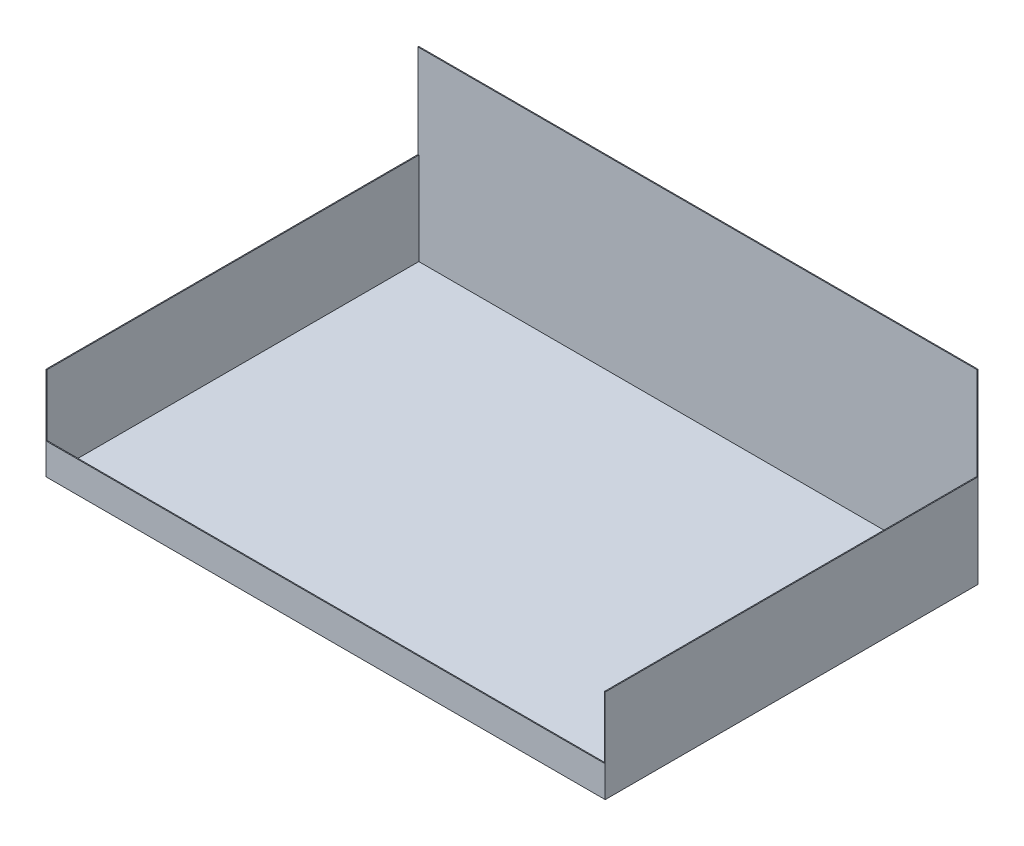
ISO-10303-21;
HEADER;
FILE_DESCRIPTION(('STEP AP214'),'2;1');
FILE_NAME('part.step','',(''),(''),'','','');
FILE_SCHEMA(('AUTOMOTIVE_DESIGN { 1 0 10303 214 1 1 1 1 }'));
ENDSEC;
DATA;
#1=APPLICATION_CONTEXT('core data for automotive mechanical design processes');
#2=APPLICATION_PROTOCOL_DEFINITION('international standard','automotive_design',2000,#1);
#3=PRODUCT_CONTEXT('',#1,'mechanical');
#4=PRODUCT('Part','Part','',(#3));
#5=PRODUCT_RELATED_PRODUCT_CATEGORY('part','',(#4));
#6=PRODUCT_DEFINITION_FORMATION('','',#4);
#7=PRODUCT_DEFINITION_CONTEXT('part definition',#1,'design');
#8=PRODUCT_DEFINITION('design','',#6,#7);
#9=PRODUCT_DEFINITION_SHAPE('','',#8);
#10=(LENGTH_UNIT() NAMED_UNIT(*) SI_UNIT(.MILLI.,.METRE.));
#11=(NAMED_UNIT(*) PLANE_ANGLE_UNIT() SI_UNIT($,.RADIAN.));
#12=(NAMED_UNIT(*) SI_UNIT($,.STERADIAN.) SOLID_ANGLE_UNIT());
#13=UNCERTAINTY_MEASURE_WITH_UNIT(LENGTH_MEASURE(1.E-05),#10,'distance_accuracy_value','');
#14=(GEOMETRIC_REPRESENTATION_CONTEXT(3) GLOBAL_UNCERTAINTY_ASSIGNED_CONTEXT((#13)) GLOBAL_UNIT_ASSIGNED_CONTEXT((#10,
#11,#12)) REPRESENTATION_CONTEXT('',''));
#15=CARTESIAN_POINT('',(0.,0.,0.));
#16=DIRECTION('',(0.,0.,1.));
#17=DIRECTION('',(1.,0.,0.));
#18=AXIS2_PLACEMENT_3D('',#15,#16,#17);
#19=CARTESIAN_POINT('',(0.,0.,0.));
#20=DIRECTION('',(0.,0.,1.));
#21=DIRECTION('',(1.,0.,0.));
#22=AXIS2_PLACEMENT_3D('',#19,#20,#21);
#23=PLANE('',#22);
#24=DIRECTION('',(1.,0.,0.));
#25=VECTOR('',#24,1.);
#26=CARTESIAN_POINT('',(-1777.58960514661,52.6595744680851,0.));
#27=LINE('',#26,#25);
#28=CARTESIAN_POINT('',(524.031914893617,52.6595744680851,0.));
#29=VERTEX_POINT('',#28);
#30=CARTESIAN_POINT('',(525.531914893617,52.6595744680851,0.));
#31=VERTEX_POINT('',#30);
#32=EDGE_CURVE('E187',#29,#31,#27,.T.);
#33=ORIENTED_EDGE('',*,*,#32,.F.);
#34=DIRECTION('',(0.,1.,0.));
#35=VECTOR('',#34,1.);
#36=CARTESIAN_POINT('',(524.031914893617,-47.3404255319149,0.));
#37=LINE('',#36,#35);
#38=CARTESIAN_POINT('',(524.031914893617,-47.3404255319149,0.));
#39=VERTEX_POINT('',#38);
#40=EDGE_CURVE('E159',#39,#29,#37,.T.);
#41=ORIENTED_EDGE('',*,*,#40,.F.);
#42=DIRECTION('',(1.,0.,0.));
#43=VECTOR('',#42,1.);
#44=CARTESIAN_POINT('',(-372.968085106383,-47.3404255319149,0.));
#45=LINE('',#44,#43);
#46=CARTESIAN_POINT('',(-372.968085106383,-47.3404255319149,0.));
#47=VERTEX_POINT('',#46);
#48=EDGE_CURVE('E161',#47,#39,#45,.T.);
#49=ORIENTED_EDGE('',*,*,#48,.F.);
#50=DIRECTION('',(0.,-1.,0.));
#51=VECTOR('',#50,1.);
#52=CARTESIAN_POINT('',(-372.968085106383,52.6595744680851,0.));
#53=LINE('',#52,#51);
#54=CARTESIAN_POINT('',(-372.968085106383,52.6595744680851,0.));
#55=VERTEX_POINT('',#54);
#56=EDGE_CURVE('E163',#55,#47,#53,.T.);
#57=ORIENTED_EDGE('',*,*,#56,.F.);
#58=CARTESIAN_POINT('',(-374.468085106383,52.6595744680851,0.));
#59=VERTEX_POINT('',#58);
#60=EDGE_CURVE('E188',#59,#55,#27,.T.);
#61=ORIENTED_EDGE('',*,*,#60,.F.);
#62=DIRECTION('',(0.,-1.,0.));
#63=VECTOR('',#62,1.);
#64=CARTESIAN_POINT('',(-374.468085106383,202.659574468085,0.));
#65=LINE('',#64,#63);
#66=CARTESIAN_POINT('',(-374.468085106383,-97.3404255319149,0.));
#67=VERTEX_POINT('',#66);
#68=EDGE_CURVE('E178',#59,#67,#65,.T.);
#69=ORIENTED_EDGE('',*,*,#68,.T.);
#70=DIRECTION('',(1.,0.,0.));
#71=VECTOR('',#70,1.);
#72=CARTESIAN_POINT('',(-374.468085106383,-97.3404255319149,0.));
#73=LINE('',#72,#71);
#74=CARTESIAN_POINT('',(525.531914893617,-97.3404255319149,0.));
#75=VERTEX_POINT('',#74);
#76=EDGE_CURVE('E208',#67,#75,#73,.T.);
#77=ORIENTED_EDGE('',*,*,#76,.T.);
#78=DIRECTION('',(0.,1.,0.));
#79=VECTOR('',#78,1.);
#80=CARTESIAN_POINT('',(525.531914893617,202.659574468085,0.));
#81=LINE('',#80,#79);
#82=EDGE_CURVE('E198',#75,#31,#81,.T.);
#83=ORIENTED_EDGE('',*,*,#82,.T.);
#84=EDGE_LOOP('',(#33,#41,#49,#57,#61,#69,#77,#83));
#85=FACE_BOUND('',#84,.T.);
#86=ADVANCED_FACE('F33',(#85),#23,.T.);
#87=CARTESIAN_POINT('',(-1777.58960514661,52.6595744680851,-598.5));
#88=DIRECTION('',(0.,1.,0.));
#89=DIRECTION('',(0.,0.,1.));
#90=AXIS2_PLACEMENT_3D('',#87,#88,#89);
#91=PLANE('',#90);
#92=DIRECTION('',(1.,0.,0.));
#93=VECTOR('',#92,1.);
#94=CARTESIAN_POINT('',(-1777.58960514661,52.6595744680851,-598.5));
#95=LINE('',#94,#93);
#96=CARTESIAN_POINT('',(524.031914893617,52.6595744680851,-598.5));
#97=VERTEX_POINT('',#96);
#98=CARTESIAN_POINT('',(525.531914893617,52.6595744680851,-598.5));
#99=VERTEX_POINT('',#98);
#100=EDGE_CURVE('E190',#97,#99,#95,.T.);
#101=ORIENTED_EDGE('',*,*,#100,.F.);
#102=DIRECTION('',(0.,0.,-1.));
#103=VECTOR('',#102,1.);
#104=CARTESIAN_POINT('',(524.031914893617,52.6595744680851,1403.12152004023));
#105=LINE('',#104,#103);
#106=EDGE_CURVE('E50',#29,#97,#105,.T.);
#107=ORIENTED_EDGE('',*,*,#106,.F.);
#108=ORIENTED_EDGE('',*,*,#32,.T.);
#109=DIRECTION('',(0.,0.,1.));
#110=VECTOR('',#109,1.);
#111=CARTESIAN_POINT('',(525.531914893617,52.6595744680851,-598.5));
#112=LINE('',#111,#110);
#113=EDGE_CURVE('E181',#99,#31,#112,.T.);
#114=ORIENTED_EDGE('',*,*,#113,.F.);
#115=EDGE_LOOP('',(#101,#107,#108,#114));
#116=FACE_BOUND('',#115,.T.);
#117=ADVANCED_FACE('F241',(#116),#91,.T.);
#118=ORIENTED_EDGE('',*,*,#60,.T.);
#119=DIRECTION('',(0.,0.,-1.));
#120=VECTOR('',#119,1.);
#121=CARTESIAN_POINT('',(-372.968085106383,52.6595744680851,1403.12152004023));
#122=LINE('',#121,#120);
#123=CARTESIAN_POINT('',(-372.968085106383,52.6595744680851,-598.5));
#124=VERTEX_POINT('',#123);
#125=EDGE_CURVE('E133',#55,#124,#122,.T.);
#126=ORIENTED_EDGE('',*,*,#125,.T.);
#127=CARTESIAN_POINT('',(-374.468085106383,52.6595744680851,-598.5));
#128=VERTEX_POINT('',#127);
#129=EDGE_CURVE('E191',#128,#124,#95,.T.);
#130=ORIENTED_EDGE('',*,*,#129,.F.);
#131=DIRECTION('',(0.,0.,1.));
#132=VECTOR('',#131,1.);
#133=CARTESIAN_POINT('',(-374.468085106383,52.6595744680851,-598.5));
#134=LINE('',#133,#132);
#135=EDGE_CURVE('E58',#128,#59,#134,.T.);
#136=ORIENTED_EDGE('',*,*,#135,.T.);
#137=EDGE_LOOP('',(#118,#126,#130,#136));
#138=FACE_BOUND('',#137,.T.);
#139=ADVANCED_FACE('F228',(#138),#91,.T.);
#140=CARTESIAN_POINT('',(-374.468085106383,202.659574468085,-600.));
#141=DIRECTION('',(-1.,0.,0.));
#142=DIRECTION('',(0.,0.,1.));
#143=AXIS2_PLACEMENT_3D('',#140,#141,#142);
#144=PLANE('',#143);
#145=ORIENTED_EDGE('',*,*,#68,.F.);
#146=ORIENTED_EDGE('',*,*,#135,.F.);
#147=DIRECTION('',(0.,-1.,0.));
#148=VECTOR('',#147,1.);
#149=CARTESIAN_POINT('',(-374.468085106383,202.659574468085,-598.5));
#150=LINE('',#149,#148);
#151=CARTESIAN_POINT('',(-374.468085106383,202.659574468085,-598.5));
#152=VERTEX_POINT('',#151);
#153=EDGE_CURVE('E176',#152,#128,#150,.T.);
#154=ORIENTED_EDGE('',*,*,#153,.F.);
#155=DIRECTION('',(0.,0.,1.));
#156=VECTOR('',#155,1.);
#157=CARTESIAN_POINT('',(-374.468085106383,202.659574468085,-600.));
#158=LINE('',#157,#156);
#159=CARTESIAN_POINT('',(-374.468085106383,202.659574468085,-600.));
#160=VERTEX_POINT('',#159);
#161=EDGE_CURVE('E11',#160,#152,#158,.T.);
#162=ORIENTED_EDGE('',*,*,#161,.F.);
#163=DIRECTION('',(0.,-1.,0.));
#164=VECTOR('',#163,1.);
#165=CARTESIAN_POINT('',(-374.468085106383,202.659574468085,-600.));
#166=LINE('',#165,#164);
#167=CARTESIAN_POINT('',(-374.468085106383,-97.3404255319149,-600.));
#168=VERTEX_POINT('',#167);
#169=EDGE_CURVE('E194',#160,#168,#166,.T.);
#170=ORIENTED_EDGE('',*,*,#169,.T.);
#171=DIRECTION('',(0.,0.,1.));
#172=VECTOR('',#171,1.);
#173=CARTESIAN_POINT('',(-374.468085106383,-97.3404255319149,-600.));
#174=LINE('',#173,#172);
#175=EDGE_CURVE('E37',#168,#67,#174,.T.);
#176=ORIENTED_EDGE('',*,*,#175,.T.);
#177=EDGE_LOOP('',(#145,#146,#154,#162,#170,#176));
#178=FACE_BOUND('',#177,.T.);
#179=ADVANCED_FACE('F35',(#178),#144,.T.);
#180=CARTESIAN_POINT('',(-374.468085106383,202.659574468085,-600.));
#181=DIRECTION('',(0.,1.,0.));
#182=DIRECTION('',(0.,0.,1.));
#183=AXIS2_PLACEMENT_3D('',#180,#181,#182);
#184=PLANE('',#183);
#185=ORIENTED_EDGE('',*,*,#161,.T.);
#186=DIRECTION('',(1.,0.,0.));
#187=VECTOR('',#186,1.);
#188=CARTESIAN_POINT('',(-1777.58960514661,202.659574468085,-598.5));
#189=LINE('',#188,#187);
#190=CARTESIAN_POINT('',(525.531914893617,202.659574468085,-598.5));
#191=VERTEX_POINT('',#190);
#192=EDGE_CURVE('E184',#152,#191,#189,.T.);
#193=ORIENTED_EDGE('',*,*,#192,.T.);
#194=DIRECTION('',(0.,0.,1.));
#195=VECTOR('',#194,1.);
#196=CARTESIAN_POINT('',(525.531914893617,202.659574468085,-600.));
#197=LINE('',#196,#195);
#198=CARTESIAN_POINT('',(525.531914893617,202.659574468085,-600.));
#199=VERTEX_POINT('',#198);
#200=EDGE_CURVE('E42',#199,#191,#197,.T.);
#201=ORIENTED_EDGE('',*,*,#200,.F.);
#202=DIRECTION('',(-1.,0.,0.));
#203=VECTOR('',#202,1.);
#204=CARTESIAN_POINT('',(-374.468085106383,202.659574468085,-600.));
#205=LINE('',#204,#203);
#206=EDGE_CURVE('E204',#199,#160,#205,.T.);
#207=ORIENTED_EDGE('',*,*,#206,.T.);
#208=EDGE_LOOP('',(#185,#193,#201,#207));
#209=FACE_BOUND('',#208,.T.);
#210=ADVANCED_FACE('F232',(#209),#184,.T.);
#211=CARTESIAN_POINT('',(525.531914893617,202.659574468085,-600.));
#212=DIRECTION('',(1.,0.,0.));
#213=DIRECTION('',(0.,1.,0.));
#214=AXIS2_PLACEMENT_3D('',#211,#212,#213);
#215=PLANE('',#214);
#216=ORIENTED_EDGE('',*,*,#200,.T.);
#217=DIRECTION('',(0.,-1.,0.));
#218=VECTOR('',#217,1.);
#219=CARTESIAN_POINT('',(525.531914893617,202.659574468085,-598.5));
#220=LINE('',#219,#218);
#221=EDGE_CURVE('E165',#191,#99,#220,.T.);
#222=ORIENTED_EDGE('',*,*,#221,.T.);
#223=ORIENTED_EDGE('',*,*,#113,.T.);
#224=ORIENTED_EDGE('',*,*,#82,.F.);
#225=DIRECTION('',(0.,0.,1.));
#226=VECTOR('',#225,1.);
#227=CARTESIAN_POINT('',(525.531914893617,-97.3404255319149,-600.));
#228=LINE('',#227,#226);
#229=CARTESIAN_POINT('',(525.531914893617,-97.3404255319149,-600.));
#230=VERTEX_POINT('',#229);
#231=EDGE_CURVE('E214',#230,#75,#228,.T.);
#232=ORIENTED_EDGE('',*,*,#231,.F.);
#233=DIRECTION('',(0.,1.,0.));
#234=VECTOR('',#233,1.);
#235=CARTESIAN_POINT('',(525.531914893617,202.659574468085,-600.));
#236=LINE('',#235,#234);
#237=EDGE_CURVE('E201',#230,#199,#236,.T.);
#238=ORIENTED_EDGE('',*,*,#237,.T.);
#239=EDGE_LOOP('',(#216,#222,#223,#224,#232,#238));
#240=FACE_BOUND('',#239,.T.);
#241=ADVANCED_FACE('F238',(#240),#215,.T.);
#242=CARTESIAN_POINT('',(-374.468085106383,-97.3404255319149,-600.));
#243=DIRECTION('',(0.,-1.,0.));
#244=DIRECTION('',(0.,0.,-1.));
#245=AXIS2_PLACEMENT_3D('',#242,#243,#244);
#246=PLANE('',#245);
#247=ORIENTED_EDGE('',*,*,#76,.F.);
#248=ORIENTED_EDGE('',*,*,#175,.F.);
#249=DIRECTION('',(1.,0.,0.));
#250=VECTOR('',#249,1.);
#251=CARTESIAN_POINT('',(-374.468085106383,-97.3404255319149,-600.));
#252=LINE('',#251,#250);
#253=EDGE_CURVE('E197',#168,#230,#252,.T.);
#254=ORIENTED_EDGE('',*,*,#253,.T.);
#255=ORIENTED_EDGE('',*,*,#231,.T.);
#256=EDGE_LOOP('',(#247,#248,#254,#255));
#257=FACE_BOUND('',#256,.T.);
#258=ADVANCED_FACE('F223',(#257),#246,.T.);
#259=CARTESIAN_POINT('',(0.,0.,-600.));
#260=DIRECTION('',(0.,0.,1.));
#261=DIRECTION('',(1.,0.,0.));
#262=AXIS2_PLACEMENT_3D('',#259,#260,#261);
#263=PLANE('',#262);
#264=ORIENTED_EDGE('',*,*,#169,.F.);
#265=ORIENTED_EDGE('',*,*,#206,.F.);
#266=ORIENTED_EDGE('',*,*,#237,.F.);
#267=ORIENTED_EDGE('',*,*,#253,.F.);
#268=EDGE_LOOP('',(#264,#265,#266,#267));
#269=FACE_BOUND('',#268,.T.);
#270=ADVANCED_FACE('F236',(#269),#263,.F.);
#271=CARTESIAN_POINT('',(-1777.58960514661,202.659574468085,-598.5));
#272=DIRECTION('',(0.,0.,1.));
#273=DIRECTION('',(1.,0.,0.));
#274=AXIS2_PLACEMENT_3D('',#271,#272,#273);
#275=PLANE('',#274);
#276=ORIENTED_EDGE('',*,*,#192,.F.);
#277=ORIENTED_EDGE('',*,*,#153,.T.);
#278=ORIENTED_EDGE('',*,*,#129,.T.);
#279=DIRECTION('',(0.,-1.,0.));
#280=VECTOR('',#279,1.);
#281=CARTESIAN_POINT('',(-372.968085106383,52.6595744680851,-598.5));
#282=LINE('',#281,#280);
#283=CARTESIAN_POINT('',(-372.968085106383,-95.8404255319149,-598.5));
#284=VERTEX_POINT('',#283);
#285=EDGE_CURVE('E134',#124,#284,#282,.T.);
#286=ORIENTED_EDGE('',*,*,#285,.T.);
#287=DIRECTION('',(1.,0.,0.));
#288=VECTOR('',#287,1.);
#289=CARTESIAN_POINT('',(-372.968085106383,-95.8404255319149,-598.5));
#290=LINE('',#289,#288);
#291=CARTESIAN_POINT('',(524.031914893617,-95.8404255319149,-598.5));
#292=VERTEX_POINT('',#291);
#293=EDGE_CURVE('E137',#284,#292,#290,.T.);
#294=ORIENTED_EDGE('',*,*,#293,.T.);
#295=DIRECTION('',(0.,1.,0.));
#296=VECTOR('',#295,1.);
#297=CARTESIAN_POINT('',(524.031914893617,-47.3404255319149,-598.5));
#298=LINE('',#297,#296);
#299=EDGE_CURVE('E124',#292,#97,#298,.T.);
#300=ORIENTED_EDGE('',*,*,#299,.T.);
#301=ORIENTED_EDGE('',*,*,#100,.T.);
#302=ORIENTED_EDGE('',*,*,#221,.F.);
#303=EDGE_LOOP('',(#276,#277,#278,#286,#294,#300,#301,#302));
#304=FACE_BOUND('',#303,.T.);
#305=ADVANCED_FACE('F138',(#304),#275,.T.);
#306=CARTESIAN_POINT('',(524.031914893617,-47.3404255319149,1403.12152004023));
#307=DIRECTION('',(-1.,0.,0.));
#308=DIRECTION('',(0.,0.,1.));
#309=AXIS2_PLACEMENT_3D('',#306,#307,#308);
#310=PLANE('',#309);
#311=DIRECTION('',(0.,0.,-1.));
#312=VECTOR('',#311,1.);
#313=CARTESIAN_POINT('',(524.031914893617,-47.3404255319149,1403.12152004023));
#314=LINE('',#313,#312);
#315=CARTESIAN_POINT('',(524.031914893617,-47.3404255319149,-1.5));
#316=VERTEX_POINT('',#315);
#317=EDGE_CURVE('E172',#39,#316,#314,.T.);
#318=ORIENTED_EDGE('',*,*,#317,.F.);
#319=ORIENTED_EDGE('',*,*,#40,.T.);
#320=ORIENTED_EDGE('',*,*,#106,.T.);
#321=ORIENTED_EDGE('',*,*,#299,.F.);
#322=DIRECTION('',(0.,0.,-1.));
#323=VECTOR('',#322,1.);
#324=CARTESIAN_POINT('',(524.031914893617,-95.8404255319149,-1.5));
#325=LINE('',#324,#323);
#326=CARTESIAN_POINT('',(524.031914893617,-95.8404255319149,-1.5));
#327=VERTEX_POINT('',#326);
#328=EDGE_CURVE('E129',#327,#292,#325,.T.);
#329=ORIENTED_EDGE('',*,*,#328,.F.);
#330=DIRECTION('',(0.,1.,0.));
#331=VECTOR('',#330,1.);
#332=CARTESIAN_POINT('',(524.031914893617,-95.8404255319149,-1.5));
#333=LINE('',#332,#331);
#334=EDGE_CURVE('E157',#327,#316,#333,.T.);
#335=ORIENTED_EDGE('',*,*,#334,.T.);
#336=EDGE_LOOP('',(#318,#319,#320,#321,#329,#335));
#337=FACE_BOUND('',#336,.T.);
#338=ADVANCED_FACE('F127',(#337),#310,.T.);
#339=CARTESIAN_POINT('',(-372.968085106383,-47.3404255319149,1403.12152004023));
#340=DIRECTION('',(0.,1.,0.));
#341=DIRECTION('',(0.,0.,1.));
#342=AXIS2_PLACEMENT_3D('',#339,#340,#341);
#343=PLANE('',#342);
#344=DIRECTION('',(1.,0.,0.));
#345=VECTOR('',#344,1.);
#346=CARTESIAN_POINT('',(-372.968085106383,-47.3404255319149,-1.5));
#347=LINE('',#346,#345);
#348=CARTESIAN_POINT('',(-372.968085106383,-47.3404255319149,-1.5));
#349=VERTEX_POINT('',#348);
#350=EDGE_CURVE('E143',#349,#316,#347,.T.);
#351=ORIENTED_EDGE('',*,*,#350,.F.);
#352=DIRECTION('',(0.,0.,-1.));
#353=VECTOR('',#352,1.);
#354=CARTESIAN_POINT('',(-372.968085106383,-47.3404255319149,1403.12152004023));
#355=LINE('',#354,#353);
#356=EDGE_CURVE('E169',#47,#349,#355,.T.);
#357=ORIENTED_EDGE('',*,*,#356,.F.);
#358=ORIENTED_EDGE('',*,*,#48,.T.);
#359=ORIENTED_EDGE('',*,*,#317,.T.);
#360=EDGE_LOOP('',(#351,#357,#358,#359));
#361=FACE_BOUND('',#360,.T.);
#362=ADVANCED_FACE('F245',(#361),#343,.T.);
#363=CARTESIAN_POINT('',(-372.968085106383,52.6595744680851,1403.12152004023));
#364=DIRECTION('',(1.,0.,0.));
#365=DIRECTION('',(0.,0.,-1.));
#366=AXIS2_PLACEMENT_3D('',#363,#364,#365);
#367=PLANE('',#366);
#368=ORIENTED_EDGE('',*,*,#125,.F.);
#369=ORIENTED_EDGE('',*,*,#56,.T.);
#370=ORIENTED_EDGE('',*,*,#356,.T.);
#371=DIRECTION('',(0.,1.,0.));
#372=VECTOR('',#371,1.);
#373=CARTESIAN_POINT('',(-372.968085106383,-95.8404255319149,-1.5));
#374=LINE('',#373,#372);
#375=CARTESIAN_POINT('',(-372.968085106383,-95.8404255319149,-1.5));
#376=VERTEX_POINT('',#375);
#377=EDGE_CURVE('E153',#376,#349,#374,.T.);
#378=ORIENTED_EDGE('',*,*,#377,.F.);
#379=DIRECTION('',(0.,0.,-1.));
#380=VECTOR('',#379,1.);
#381=CARTESIAN_POINT('',(-372.968085106383,-95.8404255319149,-1.5));
#382=LINE('',#381,#380);
#383=EDGE_CURVE('E149',#376,#284,#382,.T.);
#384=ORIENTED_EDGE('',*,*,#383,.T.);
#385=ORIENTED_EDGE('',*,*,#285,.F.);
#386=EDGE_LOOP('',(#368,#369,#370,#378,#384,#385));
#387=FACE_BOUND('',#386,.T.);
#388=ADVANCED_FACE('F247',(#387),#367,.T.);
#389=CARTESIAN_POINT('',(-372.968085106383,-95.8404255319149,-1.5));
#390=DIRECTION('',(0.,0.,1.));
#391=DIRECTION('',(1.,0.,0.));
#392=AXIS2_PLACEMENT_3D('',#389,#390,#391);
#393=PLANE('',#392);
#394=ORIENTED_EDGE('',*,*,#350,.T.);
#395=ORIENTED_EDGE('',*,*,#334,.F.);
#396=DIRECTION('',(1.,0.,0.));
#397=VECTOR('',#396,1.);
#398=CARTESIAN_POINT('',(-372.968085106383,-95.8404255319149,-1.5));
#399=LINE('',#398,#397);
#400=EDGE_CURVE('E147',#376,#327,#399,.T.);
#401=ORIENTED_EDGE('',*,*,#400,.F.);
#402=ORIENTED_EDGE('',*,*,#377,.T.);
#403=EDGE_LOOP('',(#394,#395,#401,#402));
#404=FACE_BOUND('',#403,.T.);
#405=ADVANCED_FACE('F249',(#404),#393,.F.);
#406=CARTESIAN_POINT('',(0.,-95.8404255319149,0.));
#407=DIRECTION('',(0.,1.,0.));
#408=DIRECTION('',(0.,0.,1.));
#409=AXIS2_PLACEMENT_3D('',#406,#407,#408);
#410=PLANE('',#409);
#411=ORIENTED_EDGE('',*,*,#293,.F.);
#412=ORIENTED_EDGE('',*,*,#383,.F.);
#413=ORIENTED_EDGE('',*,*,#400,.T.);
#414=ORIENTED_EDGE('',*,*,#328,.T.);
#415=EDGE_LOOP('',(#411,#412,#413,#414));
#416=FACE_BOUND('',#415,.T.);
#417=ADVANCED_FACE('F145',(#416),#410,.T.);
#418=CLOSED_SHELL('',(#86,#117,#139,#179,#210,#241,#258,#270,#305,#338,#362,#388,#405,#417));
#419=MANIFOLD_SOLID_BREP('B2',#418);
#420=ADVANCED_BREP_SHAPE_REPRESENTATION('',(#18,#419),#14);
#421=SHAPE_DEFINITION_REPRESENTATION(#9,#420);
ENDSEC;
END-ISO-10303-21;
